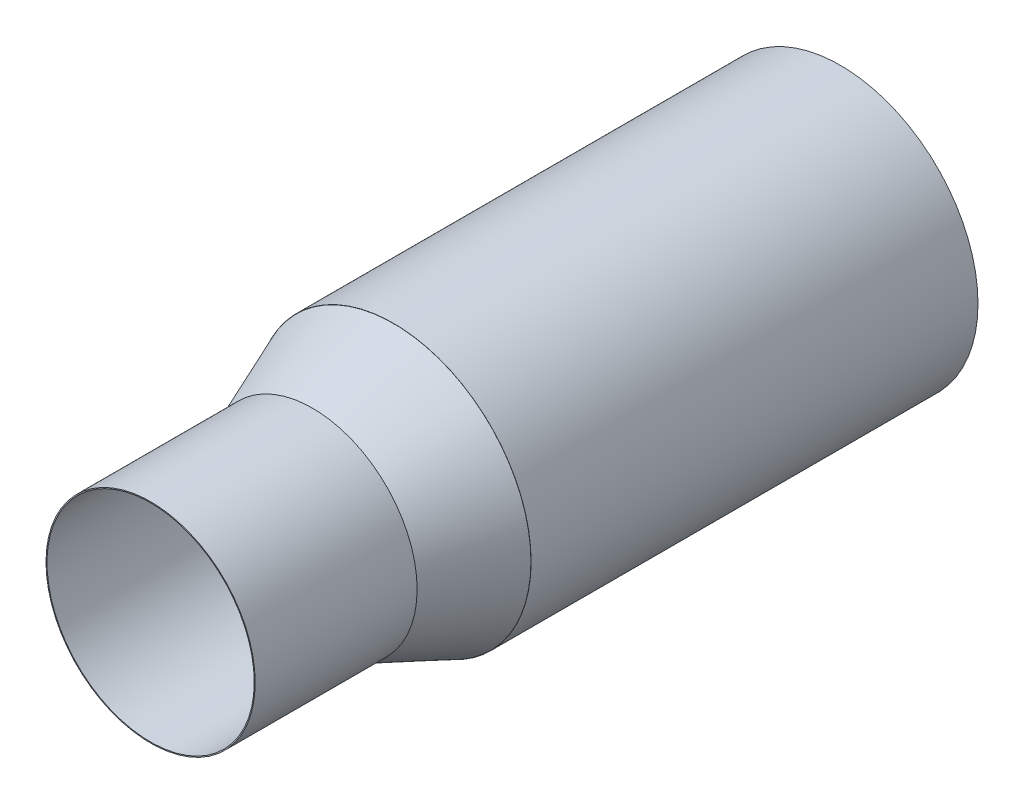
ISO-10303-21;
HEADER;
FILE_DESCRIPTION(('STEP AP214'),'2;1');
FILE_NAME('part.step','',(''),(''),'','','');
FILE_SCHEMA(('AUTOMOTIVE_DESIGN { 1 0 10303 214 1 1 1 1 }'));
ENDSEC;
DATA;
#1=APPLICATION_CONTEXT('core data for automotive mechanical design processes');
#2=APPLICATION_PROTOCOL_DEFINITION('international standard','automotive_design',2000,#1);
#3=PRODUCT_CONTEXT('',#1,'mechanical');
#4=PRODUCT('Part','Part','',(#3));
#5=PRODUCT_RELATED_PRODUCT_CATEGORY('part','',(#4));
#6=PRODUCT_DEFINITION_FORMATION('','',#4);
#7=PRODUCT_DEFINITION_CONTEXT('part definition',#1,'design');
#8=PRODUCT_DEFINITION('design','',#6,#7);
#9=PRODUCT_DEFINITION_SHAPE('','',#8);
#10=(LENGTH_UNIT() NAMED_UNIT(*) SI_UNIT(.MILLI.,.METRE.));
#11=(NAMED_UNIT(*) PLANE_ANGLE_UNIT() SI_UNIT($,.RADIAN.));
#12=(NAMED_UNIT(*) SI_UNIT($,.STERADIAN.) SOLID_ANGLE_UNIT());
#13=UNCERTAINTY_MEASURE_WITH_UNIT(LENGTH_MEASURE(1.E-05),#10,'distance_accuracy_value','');
#14=(GEOMETRIC_REPRESENTATION_CONTEXT(3) GLOBAL_UNCERTAINTY_ASSIGNED_CONTEXT((#13)) GLOBAL_UNIT_ASSIGNED_CONTEXT((#10,
#11,#12)) REPRESENTATION_CONTEXT('',''));
#15=CARTESIAN_POINT('',(0.,0.,0.));
#16=DIRECTION('',(0.,0.,1.));
#17=DIRECTION('',(1.,0.,0.));
#18=AXIS2_PLACEMENT_3D('',#15,#16,#17);
#19=CARTESIAN_POINT('',(0.,0.,108.2));
#20=DIRECTION('',(0.,0.,-1.));
#21=DIRECTION('',(-1.,0.,0.));
#22=AXIS2_PLACEMENT_3D('',#19,#20,#21);
#23=CYLINDRICAL_SURFACE('',#22,16.4084);
#24=CARTESIAN_POINT('',(0.,0.,108.2));
#25=DIRECTION('',(0.,0.,1.));
#26=DIRECTION('',(1.,0.,0.));
#27=AXIS2_PLACEMENT_3D('',#24,#25,#26);
#28=CIRCLE('',#27,16.4084);
#29=CARTESIAN_POINT('',(16.4084,0.,108.2));
#30=VERTEX_POINT('',#29);
#31=EDGE_CURVE('E100',#30,#30,#28,.T.);
#32=ORIENTED_EDGE('',*,*,#31,.F.);
#33=EDGE_LOOP('',(#32));
#34=FACE_BOUND('',#33,.T.);
#35=CARTESIAN_POINT('',(0.,0.,82.8));
#36=DIRECTION('',(0.,0.,-1.));
#37=DIRECTION('',(-1.,0.,0.));
#38=AXIS2_PLACEMENT_3D('',#35,#36,#37);
#39=CIRCLE('',#38,16.4084);
#40=CARTESIAN_POINT('',(-16.4084,0.,82.8));
#41=VERTEX_POINT('',#40);
#42=EDGE_CURVE('E11',#41,#41,#39,.T.);
#43=ORIENTED_EDGE('',*,*,#42,.F.);
#44=EDGE_LOOP('',(#43));
#45=FACE_BOUND('',#44,.T.);
#46=ADVANCED_FACE('F37',(#34,#45),#23,.T.);
#47=CARTESIAN_POINT('',(0.,0.,70.1));
#48=DIRECTION('',(0.,0.,1.));
#49=DIRECTION('',(1.,0.,0.));
#50=AXIS2_PLACEMENT_3D('',#47,#48,#49);
#51=PLANE('',#50);
#52=CARTESIAN_POINT('',(9.95557947936446,5.86947069419869,70.1));
#53=DIRECTION('',(0.,0.,1.));
#54=DIRECTION('',(1.,0.,0.));
#55=AXIS2_PLACEMENT_3D('',#52,#53,#54);
#56=CIRCLE('',#55,9.144);
#57=CARTESIAN_POINT('',(7.18292591962797,14.5829733330736,70.1));
#58=VERTEX_POINT('',#57);
#59=CARTESIAN_POINT('',(16.2375116890544,-0.775080736323875,70.1));
#60=VERTEX_POINT('',#59);
#61=EDGE_CURVE('E71',#58,#60,#56,.T.);
#62=ORIENTED_EDGE('',*,*,#61,.F.);
#63=CARTESIAN_POINT('',(0.,0.,70.1));
#64=DIRECTION('',(0.,0.,1.));
#65=DIRECTION('',(1.,0.,0.));
#66=AXIS2_PLACEMENT_3D('',#63,#64,#65);
#67=CIRCLE('',#66,16.256);
#68=CARTESIAN_POINT('',(-7.44751623688686,14.4496379851298,70.1));
#69=VERTEX_POINT('',#68);
#70=EDGE_CURVE('E58',#58,#69,#67,.T.);
#71=ORIENTED_EDGE('',*,*,#70,.T.);
#72=CARTESIAN_POINT('',(-10.0609004676266,5.68704939142529,70.1));
#73=DIRECTION('',(0.,0.,1.));
#74=DIRECTION('',(1.,0.,0.));
#75=AXIS2_PLACEMENT_3D('',#72,#73,#74);
#76=CIRCLE('',#75,9.144);
#77=CARTESIAN_POINT('',(-16.2206883289668,-1.07089034663737,70.1));
#78=VERTEX_POINT('',#77);
#79=EDGE_CURVE('E121',#78,#69,#76,.T.);
#80=ORIENTED_EDGE('',*,*,#79,.F.);
#81=CARTESIAN_POINT('',(-8.77414726783974,-13.6847314815549,70.1));
#82=VERTEX_POINT('',#81);
#83=EDGE_CURVE('E45',#78,#82,#67,.T.);
#84=ORIENTED_EDGE('',*,*,#83,.T.);
#85=CARTESIAN_POINT('',(0.118855303980422,-11.557,70.1));
#86=DIRECTION('',(0.,0.,1.));
#87=DIRECTION('',(1.,0.,0.));
#88=AXIS2_PLACEMENT_3D('',#85,#86,#87);
#89=CIRCLE('',#88,9.144);
#90=CARTESIAN_POINT('',(9.05373661670377,-13.5013847169599,70.1));
#91=VERTEX_POINT('',#90);
#92=EDGE_CURVE('E115',#91,#82,#89,.T.);
#93=ORIENTED_EDGE('',*,*,#92,.F.);
#94=EDGE_CURVE('E76',#91,#60,#67,.T.);
#95=ORIENTED_EDGE('',*,*,#94,.T.);
#96=EDGE_LOOP('',(#62,#71,#80,#84,#93,#95));
#97=FACE_BOUND('',#96,.T.);
#98=ADVANCED_FACE('F73',(#97),#51,.T.);
#99=CARTESIAN_POINT('',(0.,0.,70.1));
#100=DIRECTION('',(0.,0.,1.));
#101=DIRECTION('',(1.,0.,0.));
#102=AXIS2_PLACEMENT_3D('',#99,#100,#101);
#103=CIRCLE('',#102,21.5623465399517);
#104=CARTESIAN_POINT('',(21.5623465399517,0.,70.1));
#105=VERTEX_POINT('',#104);
#106=EDGE_CURVE('E91',#105,#105,#103,.T.);
#107=ORIENTED_EDGE('',*,*,#106,.F.);
#108=EDGE_LOOP('',(#107));
#109=FACE_BOUND('',#108,.T.);
#110=CARTESIAN_POINT('',(0.,0.,70.1));
#111=DIRECTION('',(0.,0.,1.));
#112=DIRECTION('',(1.,0.,0.));
#113=AXIS2_PLACEMENT_3D('',#110,#111,#112);
#114=CIRCLE('',#113,21.59);
#115=CARTESIAN_POINT('',(21.59,0.,70.1));
#116=VERTEX_POINT('',#115);
#117=EDGE_CURVE('E104',#116,#116,#114,.T.);
#118=ORIENTED_EDGE('',*,*,#117,.T.);
#119=EDGE_LOOP('',(#118));
#120=FACE_BOUND('',#119,.T.);
#121=ADVANCED_FACE('F148',(#109,#120),#51,.T.);
#122=CARTESIAN_POINT('',(0.,0.,0.));
#123=DIRECTION('',(0.,0.,1.));
#124=DIRECTION('',(1.,0.,0.));
#125=AXIS2_PLACEMENT_3D('',#122,#123,#124);
#126=PLANE('',#125);
#127=CARTESIAN_POINT('',(0.,0.,0.));
#128=DIRECTION('',(0.,0.,1.));
#129=DIRECTION('',(1.,0.,0.));
#130=AXIS2_PLACEMENT_3D('',#127,#128,#129);
#131=CIRCLE('',#130,21.59);
#132=CARTESIAN_POINT('',(21.59,0.,0.));
#133=VERTEX_POINT('',#132);
#134=EDGE_CURVE('E106',#133,#133,#131,.T.);
#135=ORIENTED_EDGE('',*,*,#134,.F.);
#136=EDGE_LOOP('',(#135));
#137=FACE_BOUND('',#136,.T.);
#138=CARTESIAN_POINT('',(0.118855303980422,-11.557,0.));
#139=DIRECTION('',(0.,0.,1.));
#140=DIRECTION('',(1.,0.,0.));
#141=AXIS2_PLACEMENT_3D('',#138,#139,#140);
#142=CIRCLE('',#141,9.144);
#143=CARTESIAN_POINT('',(9.26285530398042,-11.557,0.));
#144=VERTEX_POINT('',#143);
#145=EDGE_CURVE('E86',#144,#144,#142,.T.);
#146=ORIENTED_EDGE('',*,*,#145,.T.);
#147=EDGE_LOOP('',(#146));
#148=FACE_BOUND('',#147,.T.);
#149=CARTESIAN_POINT('',(9.95557947936446,5.86947069419869,0.));
#150=DIRECTION('',(0.,0.,1.));
#151=DIRECTION('',(1.,0.,0.));
#152=AXIS2_PLACEMENT_3D('',#149,#150,#151);
#153=CIRCLE('',#152,9.144);
#154=CARTESIAN_POINT('',(19.0995794793645,5.86947069419869,0.));
#155=VERTEX_POINT('',#154);
#156=EDGE_CURVE('E80',#155,#155,#153,.T.);
#157=ORIENTED_EDGE('',*,*,#156,.T.);
#158=EDGE_LOOP('',(#157));
#159=FACE_BOUND('',#158,.T.);
#160=CARTESIAN_POINT('',(-10.0609004676266,5.68704939142529,0.));
#161=DIRECTION('',(0.,0.,1.));
#162=DIRECTION('',(1.,0.,0.));
#163=AXIS2_PLACEMENT_3D('',#160,#161,#162);
#164=CIRCLE('',#163,9.144);
#165=CARTESIAN_POINT('',(-0.916900467626609,5.68704939142529,0.));
#166=VERTEX_POINT('',#165);
#167=EDGE_CURVE('E119',#166,#166,#164,.T.);
#168=ORIENTED_EDGE('',*,*,#167,.T.);
#169=EDGE_LOOP('',(#168));
#170=FACE_BOUND('',#169,.T.);
#171=ADVANCED_FACE('F164',(#137,#148,#159,#170),#126,.F.);
#172=CARTESIAN_POINT('',(0.,0.,70.1));
#173=DIRECTION('',(0.,0.,-1.));
#174=DIRECTION('',(-1.,0.,0.));
#175=AXIS2_PLACEMENT_3D('',#172,#173,#174);
#176=CYLINDRICAL_SURFACE('',#175,21.59);
#177=ORIENTED_EDGE('',*,*,#117,.F.);
#178=EDGE_LOOP('',(#177));
#179=FACE_BOUND('',#178,.T.);
#180=ORIENTED_EDGE('',*,*,#134,.T.);
#181=EDGE_LOOP('',(#180));
#182=FACE_BOUND('',#181,.T.);
#183=ADVANCED_FACE('F39',(#179,#182),#176,.T.);
#184=CARTESIAN_POINT('',(0.118855303980422,-11.557,70.1));
#185=DIRECTION('',(0.,0.,-1.));
#186=DIRECTION('',(-1.,0.,0.));
#187=AXIS2_PLACEMENT_3D('',#184,#185,#186);
#188=CYLINDRICAL_SURFACE('',#187,9.144);
#189=EDGE_CURVE('E111',#82,#91,#89,.T.);
#190=ORIENTED_EDGE('',*,*,#189,.T.);
#191=ORIENTED_EDGE('',*,*,#92,.T.);
#192=EDGE_LOOP('',(#190,#191));
#193=FACE_BOUND('',#192,.T.);
#194=ORIENTED_EDGE('',*,*,#145,.F.);
#195=EDGE_LOOP('',(#194));
#196=FACE_BOUND('',#195,.T.);
#197=ADVANCED_FACE('F160',(#193,#196),#188,.F.);
#198=CARTESIAN_POINT('',(9.95557947936446,5.86947069419869,70.1));
#199=DIRECTION('',(0.,0.,-1.));
#200=DIRECTION('',(-1.,0.,0.));
#201=AXIS2_PLACEMENT_3D('',#198,#199,#200);
#202=CYLINDRICAL_SURFACE('',#201,9.144);
#203=EDGE_CURVE('E79',#60,#58,#56,.T.);
#204=ORIENTED_EDGE('',*,*,#203,.T.);
#205=ORIENTED_EDGE('',*,*,#61,.T.);
#206=EDGE_LOOP('',(#204,#205));
#207=FACE_BOUND('',#206,.T.);
#208=ORIENTED_EDGE('',*,*,#156,.F.);
#209=EDGE_LOOP('',(#208));
#210=FACE_BOUND('',#209,.T.);
#211=ADVANCED_FACE('F83',(#207,#210),#202,.F.);
#212=CARTESIAN_POINT('',(-10.0609004676266,5.68704939142529,70.1));
#213=DIRECTION('',(0.,0.,-1.));
#214=DIRECTION('',(-1.,0.,0.));
#215=AXIS2_PLACEMENT_3D('',#212,#213,#214);
#216=CYLINDRICAL_SURFACE('',#215,9.144);
#217=EDGE_CURVE('E51',#69,#78,#76,.T.);
#218=ORIENTED_EDGE('',*,*,#217,.T.);
#219=ORIENTED_EDGE('',*,*,#79,.T.);
#220=EDGE_LOOP('',(#218,#219));
#221=FACE_BOUND('',#220,.T.);
#222=ORIENTED_EDGE('',*,*,#167,.F.);
#223=EDGE_LOOP('',(#222));
#224=FACE_BOUND('',#223,.T.);
#225=ADVANCED_FACE('F122',(#221,#224),#216,.F.);
#226=CARTESIAN_POINT('',(0.,0.,70.1));
#227=DIRECTION('',(0.,0.,1.));
#228=DIRECTION('',(1.,0.,0.));
#229=AXIS2_PLACEMENT_3D('',#226,#227,#228);
#230=PLANE('',#229);
#231=ORIENTED_EDGE('',*,*,#203,.F.);
#232=EDGE_CURVE('E87',#60,#58,#67,.T.);
#233=ORIENTED_EDGE('',*,*,#232,.T.);
#234=EDGE_LOOP('',(#231,#233));
#235=FACE_BOUND('',#234,.T.);
#236=ADVANCED_FACE('F88',(#235),#230,.F.);
#237=ORIENTED_EDGE('',*,*,#189,.F.);
#238=EDGE_CURVE('E90',#82,#91,#67,.T.);
#239=ORIENTED_EDGE('',*,*,#238,.T.);
#240=EDGE_LOOP('',(#237,#239));
#241=FACE_BOUND('',#240,.T.);
#242=ADVANCED_FACE('F130',(#241),#230,.F.);
#243=CARTESIAN_POINT('',(0.,0.,108.2));
#244=DIRECTION('',(0.,0.,-1.));
#245=DIRECTION('',(-1.,0.,0.));
#246=AXIS2_PLACEMENT_3D('',#243,#244,#245);
#247=CYLINDRICAL_SURFACE('',#246,16.256);
#248=CARTESIAN_POINT('',(0.,0.,108.2));
#249=DIRECTION('',(0.,0.,1.));
#250=DIRECTION('',(1.,0.,0.));
#251=AXIS2_PLACEMENT_3D('',#248,#249,#250);
#252=CIRCLE('',#251,16.256);
#253=CARTESIAN_POINT('',(16.256,0.,108.2));
#254=VERTEX_POINT('',#253);
#255=EDGE_CURVE('E98',#254,#254,#252,.T.);
#256=ORIENTED_EDGE('',*,*,#255,.T.);
#257=EDGE_LOOP('',(#256));
#258=FACE_BOUND('',#257,.T.);
#259=ORIENTED_EDGE('',*,*,#70,.F.);
#260=ORIENTED_EDGE('',*,*,#232,.F.);
#261=ORIENTED_EDGE('',*,*,#94,.F.);
#262=ORIENTED_EDGE('',*,*,#238,.F.);
#263=ORIENTED_EDGE('',*,*,#83,.F.);
#264=EDGE_CURVE('E97',#69,#78,#67,.T.);
#265=ORIENTED_EDGE('',*,*,#264,.F.);
#266=EDGE_LOOP('',(#259,#260,#261,#262,#263,#265));
#267=FACE_BOUND('',#266,.T.);
#268=ADVANCED_FACE('F94',(#258,#267),#247,.F.);
#269=CARTESIAN_POINT('',(0.,0.,108.2));
#270=DIRECTION('',(0.,0.,1.));
#271=DIRECTION('',(1.,0.,0.));
#272=AXIS2_PLACEMENT_3D('',#269,#270,#271);
#273=PLANE('',#272);
#274=ORIENTED_EDGE('',*,*,#255,.F.);
#275=EDGE_LOOP('',(#274));
#276=FACE_BOUND('',#275,.T.);
#277=ORIENTED_EDGE('',*,*,#31,.T.);
#278=EDGE_LOOP('',(#277));
#279=FACE_BOUND('',#278,.T.);
#280=ADVANCED_FACE('F128',(#276,#279),#273,.T.);
#281=ORIENTED_EDGE('',*,*,#217,.F.);
#282=ORIENTED_EDGE('',*,*,#264,.T.);
#283=EDGE_LOOP('',(#281,#282));
#284=FACE_BOUND('',#283,.T.);
#285=ADVANCED_FACE('F125',(#284),#230,.F.);
#286=CARTESIAN_POINT('',(0.,0.,70.1));
#287=DIRECTION('',(0.,0.,-1.));
#288=DIRECTION('',(-1.,0.,0.));
#289=AXIS2_PLACEMENT_3D('',#286,#287,#288);
#290=CONICAL_SURFACE('',#289,21.5623465399517,0.385515727626035);
#291=ORIENTED_EDGE('',*,*,#42,.T.);
#292=EDGE_LOOP('',(#291));
#293=FACE_BOUND('',#292,.T.);
#294=ORIENTED_EDGE('',*,*,#106,.T.);
#295=EDGE_LOOP('',(#294));
#296=FACE_BOUND('',#295,.T.);
#297=ADVANCED_FACE('F127',(#293,#296),#290,.T.);
#298=CLOSED_SHELL('',(#46,#98,#121,#171,#183,#197,#211,#225,#236,#242,#268,#280,#285,#297));
#299=MANIFOLD_SOLID_BREP('B2',#298);
#300=ADVANCED_BREP_SHAPE_REPRESENTATION('',(#18,#299),#14);
#301=SHAPE_DEFINITION_REPRESENTATION(#9,#300);
ENDSEC;
END-ISO-10303-21;
